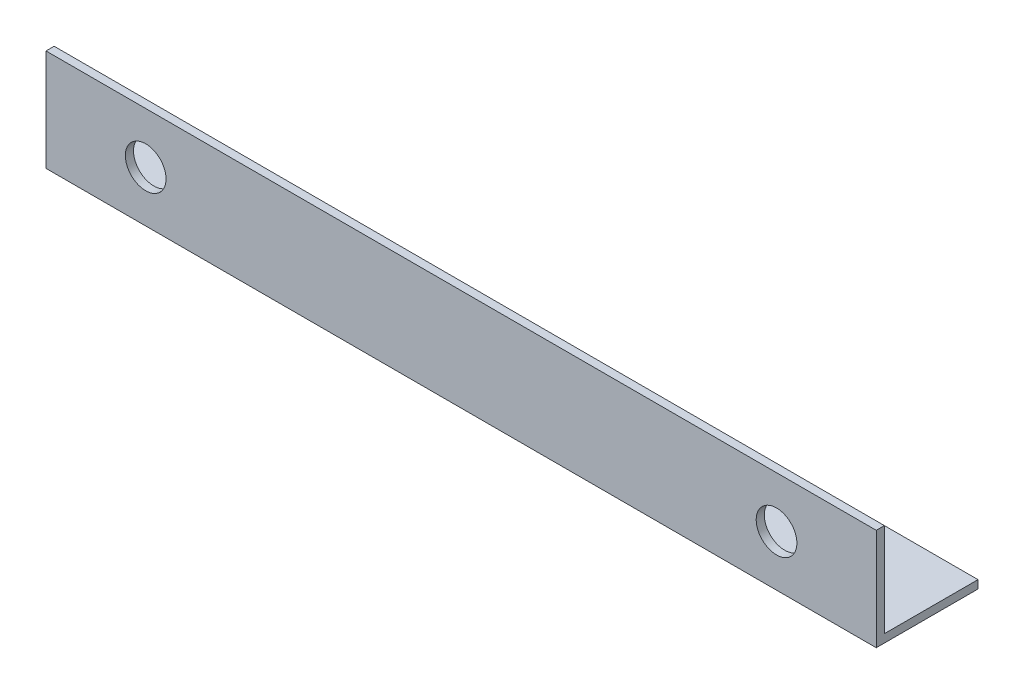
ISO-10303-21;
HEADER;
FILE_DESCRIPTION(('STEP AP214'),'2;1');
FILE_NAME('part.step','',(''),(''),'','','');
FILE_SCHEMA(('AUTOMOTIVE_DESIGN { 1 0 10303 214 1 1 1 1 }'));
ENDSEC;
DATA;
#1=APPLICATION_CONTEXT('core data for automotive mechanical design processes');
#2=APPLICATION_PROTOCOL_DEFINITION('international standard','automotive_design',2000,#1);
#3=PRODUCT_CONTEXT('',#1,'mechanical');
#4=PRODUCT('Part','Part','',(#3));
#5=PRODUCT_RELATED_PRODUCT_CATEGORY('part','',(#4));
#6=PRODUCT_DEFINITION_FORMATION('','',#4);
#7=PRODUCT_DEFINITION_CONTEXT('part definition',#1,'design');
#8=PRODUCT_DEFINITION('design','',#6,#7);
#9=PRODUCT_DEFINITION_SHAPE('','',#8);
#10=(LENGTH_UNIT() NAMED_UNIT(*) SI_UNIT(.MILLI.,.METRE.));
#11=(NAMED_UNIT(*) PLANE_ANGLE_UNIT() SI_UNIT($,.RADIAN.));
#12=(NAMED_UNIT(*) SI_UNIT($,.STERADIAN.) SOLID_ANGLE_UNIT());
#13=UNCERTAINTY_MEASURE_WITH_UNIT(LENGTH_MEASURE(1.E-05),#10,'distance_accuracy_value','');
#14=(GEOMETRIC_REPRESENTATION_CONTEXT(3) GLOBAL_UNCERTAINTY_ASSIGNED_CONTEXT((#13)) GLOBAL_UNIT_ASSIGNED_CONTEXT((#10,
#11,#12)) REPRESENTATION_CONTEXT('',''));
#15=CARTESIAN_POINT('',(0.,0.,0.));
#16=DIRECTION('',(0.,0.,1.));
#17=DIRECTION('',(1.,0.,0.));
#18=AXIS2_PLACEMENT_3D('',#15,#16,#17);
#19=CARTESIAN_POINT('',(204.,0.,0.));
#20=DIRECTION('',(0.,1.,0.));
#21=DIRECTION('',(0.,0.,1.));
#22=AXIS2_PLACEMENT_3D('',#19,#20,#21);
#23=PLANE('',#22);
#24=DIRECTION('',(0.,0.,-1.));
#25=VECTOR('',#24,1.);
#26=CARTESIAN_POINT('',(0.,0.,0.));
#27=LINE('',#26,#25);
#28=CARTESIAN_POINT('',(0.,0.,0.));
#29=VERTEX_POINT('',#28);
#30=CARTESIAN_POINT('',(0.,0.,-25.));
#31=VERTEX_POINT('',#30);
#32=EDGE_CURVE('E115',#29,#31,#27,.T.);
#33=ORIENTED_EDGE('',*,*,#32,.T.);
#34=DIRECTION('',(-1.,0.,0.));
#35=VECTOR('',#34,1.);
#36=CARTESIAN_POINT('',(204.,0.,-25.));
#37=LINE('',#36,#35);
#38=CARTESIAN_POINT('',(204.,0.,-25.));
#39=VERTEX_POINT('',#38);
#40=EDGE_CURVE('E11',#39,#31,#37,.T.);
#41=ORIENTED_EDGE('',*,*,#40,.F.);
#42=DIRECTION('',(0.,0.,-1.));
#43=VECTOR('',#42,1.);
#44=CARTESIAN_POINT('',(204.,0.,0.));
#45=LINE('',#44,#43);
#46=CARTESIAN_POINT('',(204.,0.,0.));
#47=VERTEX_POINT('',#46);
#48=EDGE_CURVE('E80',#47,#39,#45,.T.);
#49=ORIENTED_EDGE('',*,*,#48,.F.);
#50=DIRECTION('',(-1.,0.,0.));
#51=VECTOR('',#50,1.);
#52=CARTESIAN_POINT('',(204.,0.,0.));
#53=LINE('',#52,#51);
#54=EDGE_CURVE('E111',#47,#29,#53,.T.);
#55=ORIENTED_EDGE('',*,*,#54,.T.);
#56=EDGE_LOOP('',(#33,#41,#49,#55));
#57=FACE_BOUND('',#56,.T.);
#58=ADVANCED_FACE('F34',(#57),#23,.F.);
#59=CARTESIAN_POINT('',(204.,2.,-25.));
#60=DIRECTION('',(0.,0.,-1.));
#61=DIRECTION('',(-1.,0.,0.));
#62=AXIS2_PLACEMENT_3D('',#59,#60,#61);
#63=PLANE('',#62);
#64=DIRECTION('',(0.,-1.,0.));
#65=VECTOR('',#64,1.);
#66=CARTESIAN_POINT('',(0.,2.,-25.));
#67=LINE('',#66,#65);
#68=CARTESIAN_POINT('',(0.,2.,-25.));
#69=VERTEX_POINT('',#68);
#70=EDGE_CURVE('E118',#69,#31,#67,.T.);
#71=ORIENTED_EDGE('',*,*,#70,.F.);
#72=DIRECTION('',(-1.,0.,0.));
#73=VECTOR('',#72,1.);
#74=CARTESIAN_POINT('',(204.,2.,-25.));
#75=LINE('',#74,#73);
#76=CARTESIAN_POINT('',(204.,2.,-25.));
#77=VERTEX_POINT('',#76);
#78=EDGE_CURVE('E42',#77,#69,#75,.T.);
#79=ORIENTED_EDGE('',*,*,#78,.F.);
#80=DIRECTION('',(0.,-1.,0.));
#81=VECTOR('',#80,1.);
#82=CARTESIAN_POINT('',(204.,2.,-25.));
#83=LINE('',#82,#81);
#84=EDGE_CURVE('E182',#77,#39,#83,.T.);
#85=ORIENTED_EDGE('',*,*,#84,.T.);
#86=ORIENTED_EDGE('',*,*,#40,.T.);
#87=EDGE_LOOP('',(#71,#79,#85,#86));
#88=FACE_BOUND('',#87,.T.);
#89=ADVANCED_FACE('F137',(#88),#63,.T.);
#90=CARTESIAN_POINT('',(204.,2.,0.));
#91=DIRECTION('',(0.,1.,0.));
#92=DIRECTION('',(0.,0.,1.));
#93=AXIS2_PLACEMENT_3D('',#90,#91,#92);
#94=PLANE('',#93);
#95=DIRECTION('',(0.,0.,-1.));
#96=VECTOR('',#95,1.);
#97=CARTESIAN_POINT('',(0.,2.,0.));
#98=LINE('',#97,#96);
#99=CARTESIAN_POINT('',(0.,2.,-2.));
#100=VERTEX_POINT('',#99);
#101=EDGE_CURVE('E122',#100,#69,#98,.T.);
#102=ORIENTED_EDGE('',*,*,#101,.F.);
#103=DIRECTION('',(-1.,0.,0.));
#104=VECTOR('',#103,1.);
#105=CARTESIAN_POINT('',(204.,2.,-2.));
#106=LINE('',#105,#104);
#107=CARTESIAN_POINT('',(204.,2.,-2.));
#108=VERTEX_POINT('',#107);
#109=EDGE_CURVE('E101',#108,#100,#106,.T.);
#110=ORIENTED_EDGE('',*,*,#109,.F.);
#111=DIRECTION('',(0.,0.,-1.));
#112=VECTOR('',#111,1.);
#113=CARTESIAN_POINT('',(204.,2.,0.));
#114=LINE('',#113,#112);
#115=EDGE_CURVE('E107',#108,#77,#114,.T.);
#116=ORIENTED_EDGE('',*,*,#115,.T.);
#117=ORIENTED_EDGE('',*,*,#78,.T.);
#118=EDGE_LOOP('',(#102,#110,#116,#117));
#119=FACE_BOUND('',#118,.T.);
#120=ADVANCED_FACE('F134',(#119),#94,.T.);
#121=CARTESIAN_POINT('',(204.,25.,-2.));
#122=DIRECTION('',(0.,0.,-1.));
#123=DIRECTION('',(0.,1.,0.));
#124=AXIS2_PLACEMENT_3D('',#121,#122,#123);
#125=PLANE('',#124);
#126=CARTESIAN_POINT('',(179.5,12.5,-2.));
#127=DIRECTION('',(0.,0.,-1.));
#128=DIRECTION('',(0.,1.,0.));
#129=AXIS2_PLACEMENT_3D('',#126,#127,#128);
#130=CIRCLE('',#129,4.99999999999999);
#131=CARTESIAN_POINT('',(179.5,17.5,-2.));
#132=VERTEX_POINT('',#131);
#133=EDGE_CURVE('E171',#132,#132,#130,.T.);
#134=ORIENTED_EDGE('',*,*,#133,.F.);
#135=EDGE_LOOP('',(#134));
#136=FACE_BOUND('',#135,.T.);
#137=CARTESIAN_POINT('',(24.5,12.5,-2.));
#138=DIRECTION('',(0.,0.,-1.));
#139=DIRECTION('',(0.,1.,0.));
#140=AXIS2_PLACEMENT_3D('',#137,#138,#139);
#141=CIRCLE('',#140,4.99999999999999);
#142=CARTESIAN_POINT('',(24.5,17.5,-2.));
#143=VERTEX_POINT('',#142);
#144=EDGE_CURVE('E119',#143,#143,#141,.T.);
#145=ORIENTED_EDGE('',*,*,#144,.F.);
#146=EDGE_LOOP('',(#145));
#147=FACE_BOUND('',#146,.T.);
#148=DIRECTION('',(0.,-1.,0.));
#149=VECTOR('',#148,1.);
#150=CARTESIAN_POINT('',(0.,25.,-2.));
#151=LINE('',#150,#149);
#152=CARTESIAN_POINT('',(0.,25.,-2.));
#153=VERTEX_POINT('',#152);
#154=EDGE_CURVE('E96',#153,#100,#151,.T.);
#155=ORIENTED_EDGE('',*,*,#154,.F.);
#156=DIRECTION('',(-1.,0.,0.));
#157=VECTOR('',#156,1.);
#158=CARTESIAN_POINT('',(204.,25.,-2.));
#159=LINE('',#158,#157);
#160=CARTESIAN_POINT('',(204.,25.,-2.));
#161=VERTEX_POINT('',#160);
#162=EDGE_CURVE('E91',#161,#153,#159,.T.);
#163=ORIENTED_EDGE('',*,*,#162,.F.);
#164=DIRECTION('',(0.,-1.,0.));
#165=VECTOR('',#164,1.);
#166=CARTESIAN_POINT('',(204.,25.,-2.));
#167=LINE('',#166,#165);
#168=EDGE_CURVE('E94',#161,#108,#167,.T.);
#169=ORIENTED_EDGE('',*,*,#168,.T.);
#170=ORIENTED_EDGE('',*,*,#109,.T.);
#171=EDGE_LOOP('',(#155,#163,#169,#170));
#172=FACE_BOUND('',#171,.T.);
#173=ADVANCED_FACE('F93',(#136,#147,#172),#125,.T.);
#174=CARTESIAN_POINT('',(204.,25.,0.));
#175=DIRECTION('',(0.,1.,0.));
#176=DIRECTION('',(0.,0.,1.));
#177=AXIS2_PLACEMENT_3D('',#174,#175,#176);
#178=PLANE('',#177);
#179=DIRECTION('',(0.,0.,-1.));
#180=VECTOR('',#179,1.);
#181=CARTESIAN_POINT('',(0.,25.,0.));
#182=LINE('',#181,#180);
#183=CARTESIAN_POINT('',(0.,25.,0.));
#184=VERTEX_POINT('',#183);
#185=EDGE_CURVE('E126',#184,#153,#182,.T.);
#186=ORIENTED_EDGE('',*,*,#185,.F.);
#187=DIRECTION('',(-1.,0.,0.));
#188=VECTOR('',#187,1.);
#189=CARTESIAN_POINT('',(204.,25.,0.));
#190=LINE('',#189,#188);
#191=CARTESIAN_POINT('',(204.,25.,0.));
#192=VERTEX_POINT('',#191);
#193=EDGE_CURVE('E71',#192,#184,#190,.T.);
#194=ORIENTED_EDGE('',*,*,#193,.F.);
#195=DIRECTION('',(0.,0.,-1.));
#196=VECTOR('',#195,1.);
#197=CARTESIAN_POINT('',(204.,25.,0.));
#198=LINE('',#197,#196);
#199=EDGE_CURVE('E105',#192,#161,#198,.T.);
#200=ORIENTED_EDGE('',*,*,#199,.T.);
#201=ORIENTED_EDGE('',*,*,#162,.T.);
#202=EDGE_LOOP('',(#186,#194,#200,#201));
#203=FACE_BOUND('',#202,.T.);
#204=ADVANCED_FACE('F109',(#203),#178,.T.);
#205=CARTESIAN_POINT('',(204.,25.,0.));
#206=DIRECTION('',(0.,0.,-1.));
#207=DIRECTION('',(0.,1.,0.));
#208=AXIS2_PLACEMENT_3D('',#205,#206,#207);
#209=PLANE('',#208);
#210=CARTESIAN_POINT('',(179.5,12.5,0.));
#211=DIRECTION('',(0.,0.,1.));
#212=DIRECTION('',(-1.,0.,0.));
#213=AXIS2_PLACEMENT_3D('',#210,#211,#212);
#214=CIRCLE('',#213,4.99999999999999);
#215=CARTESIAN_POINT('',(174.5,12.5,0.));
#216=VERTEX_POINT('',#215);
#217=EDGE_CURVE('E184',#216,#216,#214,.T.);
#218=ORIENTED_EDGE('',*,*,#217,.F.);
#219=EDGE_LOOP('',(#218));
#220=FACE_BOUND('',#219,.T.);
#221=CARTESIAN_POINT('',(24.5,12.5,0.));
#222=DIRECTION('',(0.,0.,1.));
#223=DIRECTION('',(1.,0.,0.));
#224=AXIS2_PLACEMENT_3D('',#221,#222,#223);
#225=CIRCLE('',#224,4.99999999999999);
#226=CARTESIAN_POINT('',(29.5,12.5,0.));
#227=VERTEX_POINT('',#226);
#228=EDGE_CURVE('E175',#227,#227,#225,.T.);
#229=ORIENTED_EDGE('',*,*,#228,.F.);
#230=EDGE_LOOP('',(#229));
#231=FACE_BOUND('',#230,.T.);
#232=DIRECTION('',(0.,-1.,0.));
#233=VECTOR('',#232,1.);
#234=CARTESIAN_POINT('',(0.,25.,0.));
#235=LINE('',#234,#233);
#236=EDGE_CURVE('E74',#184,#29,#235,.T.);
#237=ORIENTED_EDGE('',*,*,#236,.T.);
#238=ORIENTED_EDGE('',*,*,#54,.F.);
#239=DIRECTION('',(0.,-1.,0.));
#240=VECTOR('',#239,1.);
#241=CARTESIAN_POINT('',(204.,25.,0.));
#242=LINE('',#241,#240);
#243=EDGE_CURVE('E50',#192,#47,#242,.T.);
#244=ORIENTED_EDGE('',*,*,#243,.F.);
#245=ORIENTED_EDGE('',*,*,#193,.T.);
#246=EDGE_LOOP('',(#237,#238,#244,#245));
#247=FACE_BOUND('',#246,.T.);
#248=ADVANCED_FACE('F142',(#220,#231,#247),#209,.F.);
#249=CARTESIAN_POINT('',(204.,0.,0.));
#250=DIRECTION('',(-1.,0.,0.));
#251=DIRECTION('',(0.,0.,1.));
#252=AXIS2_PLACEMENT_3D('',#249,#250,#251);
#253=PLANE('',#252);
#254=ORIENTED_EDGE('',*,*,#48,.T.);
#255=ORIENTED_EDGE('',*,*,#84,.F.);
#256=ORIENTED_EDGE('',*,*,#115,.F.);
#257=ORIENTED_EDGE('',*,*,#168,.F.);
#258=ORIENTED_EDGE('',*,*,#199,.F.);
#259=ORIENTED_EDGE('',*,*,#243,.T.);
#260=EDGE_LOOP('',(#254,#255,#256,#257,#258,#259));
#261=FACE_BOUND('',#260,.T.);
#262=ADVANCED_FACE('F104',(#261),#253,.F.);
#263=CARTESIAN_POINT('',(0.,0.,0.));
#264=DIRECTION('',(-1.,0.,0.));
#265=DIRECTION('',(0.,0.,1.));
#266=AXIS2_PLACEMENT_3D('',#263,#264,#265);
#267=PLANE('',#266);
#268=ORIENTED_EDGE('',*,*,#32,.F.);
#269=ORIENTED_EDGE('',*,*,#236,.F.);
#270=ORIENTED_EDGE('',*,*,#185,.T.);
#271=ORIENTED_EDGE('',*,*,#154,.T.);
#272=ORIENTED_EDGE('',*,*,#101,.T.);
#273=ORIENTED_EDGE('',*,*,#70,.T.);
#274=EDGE_LOOP('',(#268,#269,#270,#271,#272,#273));
#275=FACE_BOUND('',#274,.T.);
#276=ADVANCED_FACE('F140',(#275),#267,.T.);
#277=CARTESIAN_POINT('',(24.5,12.5,-25.));
#278=DIRECTION('',(0.,0.,1.));
#279=DIRECTION('',(1.,0.,0.));
#280=AXIS2_PLACEMENT_3D('',#277,#278,#279);
#281=CYLINDRICAL_SURFACE('',#280,4.99999999999999);
#282=ORIENTED_EDGE('',*,*,#144,.T.);
#283=EDGE_LOOP('',(#282));
#284=FACE_BOUND('',#283,.T.);
#285=ORIENTED_EDGE('',*,*,#228,.T.);
#286=EDGE_LOOP('',(#285));
#287=FACE_BOUND('',#286,.T.);
#288=ADVANCED_FACE('F189',(#284,#287),#281,.F.);
#289=CARTESIAN_POINT('',(179.5,12.5,-25.));
#290=DIRECTION('',(0.,0.,1.));
#291=DIRECTION('',(1.,0.,0.));
#292=AXIS2_PLACEMENT_3D('',#289,#290,#291);
#293=CYLINDRICAL_SURFACE('',#292,4.99999999999999);
#294=ORIENTED_EDGE('',*,*,#133,.T.);
#295=EDGE_LOOP('',(#294));
#296=FACE_BOUND('',#295,.T.);
#297=ORIENTED_EDGE('',*,*,#217,.T.);
#298=EDGE_LOOP('',(#297));
#299=FACE_BOUND('',#298,.T.);
#300=ADVANCED_FACE('F187',(#296,#299),#293,.F.);
#301=CLOSED_SHELL('',(#58,#89,#120,#173,#204,#248,#262,#276,#288,#300));
#302=MANIFOLD_SOLID_BREP('B2',#301);
#303=ADVANCED_BREP_SHAPE_REPRESENTATION('',(#18,#302),#14);
#304=SHAPE_DEFINITION_REPRESENTATION(#9,#303);
ENDSEC;
END-ISO-10303-21;
